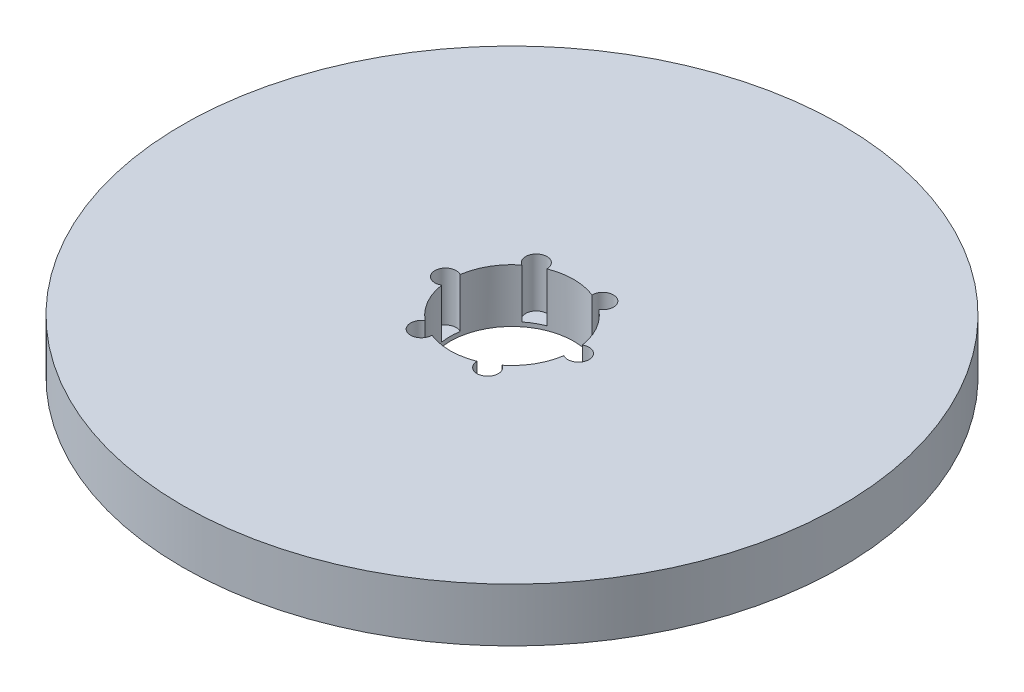
ISO-10303-21;
HEADER;
FILE_DESCRIPTION(('STEP AP214'),'2;1');
FILE_NAME('part.step','',(''),(''),'','','');
FILE_SCHEMA(('AUTOMOTIVE_DESIGN { 1 0 10303 214 1 1 1 1 }'));
ENDSEC;
DATA;
#1=APPLICATION_CONTEXT('core data for automotive mechanical design processes');
#2=APPLICATION_PROTOCOL_DEFINITION('international standard','automotive_design',2000,#1);
#3=PRODUCT_CONTEXT('',#1,'mechanical');
#4=PRODUCT('Part','Part','',(#3));
#5=PRODUCT_RELATED_PRODUCT_CATEGORY('part','',(#4));
#6=PRODUCT_DEFINITION_FORMATION('','',#4);
#7=PRODUCT_DEFINITION_CONTEXT('part definition',#1,'design');
#8=PRODUCT_DEFINITION('design','',#6,#7);
#9=PRODUCT_DEFINITION_SHAPE('','',#8);
#10=(LENGTH_UNIT() NAMED_UNIT(*) SI_UNIT(.MILLI.,.METRE.));
#11=(NAMED_UNIT(*) PLANE_ANGLE_UNIT() SI_UNIT($,.RADIAN.));
#12=(NAMED_UNIT(*) SI_UNIT($,.STERADIAN.) SOLID_ANGLE_UNIT());
#13=UNCERTAINTY_MEASURE_WITH_UNIT(LENGTH_MEASURE(1.E-05),#10,'distance_accuracy_value','');
#14=(GEOMETRIC_REPRESENTATION_CONTEXT(3) GLOBAL_UNCERTAINTY_ASSIGNED_CONTEXT((#13)) GLOBAL_UNIT_ASSIGNED_CONTEXT((#10,
#11,#12)) REPRESENTATION_CONTEXT('',''));
#15=CARTESIAN_POINT('',(0.,0.,0.));
#16=DIRECTION('',(0.,0.,1.));
#17=DIRECTION('',(1.,0.,0.));
#18=AXIS2_PLACEMENT_3D('',#15,#16,#17);
#19=CARTESIAN_POINT('',(0.,13.,0.));
#20=DIRECTION('',(0.,-1.,0.));
#21=DIRECTION('',(0.,0.,-1.));
#22=AXIS2_PLACEMENT_3D('',#19,#20,#21);
#23=CYLINDRICAL_SURFACE('',#22,80.);
#24=CARTESIAN_POINT('',(0.,13.,0.));
#25=DIRECTION('',(0.,1.,0.));
#26=DIRECTION('',(0.,0.,1.));
#27=AXIS2_PLACEMENT_3D('',#24,#25,#26);
#28=CIRCLE('',#27,80.);
#29=CARTESIAN_POINT('',(0.,13.,-80.));
#30=VERTEX_POINT('',#29);
#31=EDGE_CURVE('E171',#30,#30,#28,.T.);
#32=CARTESIAN_POINT('',(0.,0.,0.));
#33=DIRECTION('',(0.,1.,0.));
#34=DIRECTION('',(0.,0.,1.));
#35=AXIS2_PLACEMENT_3D('',#32,#33,#34);
#36=CIRCLE('',#35,80.);
#37=CARTESIAN_POINT('',(0.,0.,-80.));
#38=VERTEX_POINT('',#37);
#39=EDGE_CURVE('E157',#38,#38,#36,.T.);
#40=CARTESIAN_POINT('',(0.,13.,-80.));
#41=CARTESIAN_POINT('',(0.,12.8645833333333,-80.));
#42=CARTESIAN_POINT('',(0.,12.7291666666667,-80.));
#43=CARTESIAN_POINT('',(0.,12.4583333333333,-80.));
#44=CARTESIAN_POINT('',(0.,12.3229166666667,-80.));
#45=CARTESIAN_POINT('',(0.,12.0520833333333,-80.));
#46=CARTESIAN_POINT('',(0.,11.9166666666667,-80.));
#47=CARTESIAN_POINT('',(0.,11.6458333333333,-80.));
#48=CARTESIAN_POINT('',(0.,11.5104166666667,-80.));
#49=CARTESIAN_POINT('',(0.,11.2395833333333,-80.));
#50=CARTESIAN_POINT('',(0.,11.1041666666667,-80.));
#51=CARTESIAN_POINT('',(0.,10.8333333333333,-80.));
#52=CARTESIAN_POINT('',(0.,10.6979166666667,-80.));
#53=CARTESIAN_POINT('',(0.,10.4270833333333,-80.));
#54=CARTESIAN_POINT('',(0.,10.2916666666667,-80.));
#55=CARTESIAN_POINT('',(0.,10.0208333333333,-80.));
#56=CARTESIAN_POINT('',(0.,9.88541666666667,-80.));
#57=CARTESIAN_POINT('',(0.,9.61458333333333,-80.));
#58=CARTESIAN_POINT('',(0.,9.47916666666667,-80.));
#59=CARTESIAN_POINT('',(0.,9.20833333333333,-80.));
#60=CARTESIAN_POINT('',(0.,9.07291666666667,-80.));
#61=CARTESIAN_POINT('',(0.,8.80208333333333,-80.));
#62=CARTESIAN_POINT('',(0.,8.66666666666667,-80.));
#63=CARTESIAN_POINT('',(0.,8.39583333333333,-80.));
#64=CARTESIAN_POINT('',(0.,8.26041666666667,-80.));
#65=CARTESIAN_POINT('',(0.,7.98958333333333,-80.));
#66=CARTESIAN_POINT('',(0.,7.85416666666667,-80.));
#67=CARTESIAN_POINT('',(0.,7.58333333333333,-80.));
#68=CARTESIAN_POINT('',(0.,7.44791666666667,-80.));
#69=CARTESIAN_POINT('',(0.,7.17708333333333,-80.));
#70=CARTESIAN_POINT('',(0.,7.04166666666667,-80.));
#71=CARTESIAN_POINT('',(0.,6.77083333333333,-80.));
#72=CARTESIAN_POINT('',(0.,6.63541666666667,-80.));
#73=CARTESIAN_POINT('',(0.,6.36458333333333,-80.));
#74=CARTESIAN_POINT('',(0.,6.22916666666667,-80.));
#75=CARTESIAN_POINT('',(0.,5.95833333333333,-80.));
#76=CARTESIAN_POINT('',(0.,5.82291666666667,-80.));
#77=CARTESIAN_POINT('',(0.,5.55208333333333,-80.));
#78=CARTESIAN_POINT('',(0.,5.41666666666667,-80.));
#79=CARTESIAN_POINT('',(0.,5.14583333333333,-80.));
#80=CARTESIAN_POINT('',(0.,5.01041666666667,-80.));
#81=CARTESIAN_POINT('',(0.,4.73958333333333,-80.));
#82=CARTESIAN_POINT('',(0.,4.60416666666667,-80.));
#83=CARTESIAN_POINT('',(0.,4.33333333333333,-80.));
#84=CARTESIAN_POINT('',(0.,4.19791666666667,-80.));
#85=CARTESIAN_POINT('',(0.,3.92708333333333,-80.));
#86=CARTESIAN_POINT('',(0.,3.79166666666667,-80.));
#87=CARTESIAN_POINT('',(0.,3.52083333333333,-80.));
#88=CARTESIAN_POINT('',(0.,3.38541666666667,-80.));
#89=CARTESIAN_POINT('',(0.,3.11458333333333,-80.));
#90=CARTESIAN_POINT('',(0.,2.97916666666667,-80.));
#91=CARTESIAN_POINT('',(0.,2.70833333333333,-80.));
#92=CARTESIAN_POINT('',(0.,2.57291666666667,-80.));
#93=CARTESIAN_POINT('',(0.,2.30208333333333,-80.));
#94=CARTESIAN_POINT('',(0.,2.16666666666667,-80.));
#95=CARTESIAN_POINT('',(0.,1.89583333333333,-80.));
#96=CARTESIAN_POINT('',(0.,1.76041666666667,-80.));
#97=CARTESIAN_POINT('',(0.,1.48958333333333,-80.));
#98=CARTESIAN_POINT('',(0.,1.35416666666667,-80.));
#99=CARTESIAN_POINT('',(0.,1.08333333333333,-80.));
#100=CARTESIAN_POINT('',(0.,0.947916666666667,-80.));
#101=CARTESIAN_POINT('',(0.,0.677083333333334,-80.));
#102=CARTESIAN_POINT('',(0.,0.541666666666667,-80.));
#103=CARTESIAN_POINT('',(0.,0.270833333333334,-80.));
#104=CARTESIAN_POINT('',(0.,0.135416666666667,-80.));
#105=CARTESIAN_POINT('',(0.,0.,-80.));
#106=B_SPLINE_CURVE_WITH_KNOTS('',3,(#40,#41,#42,#43,#44,#45,#46,#47,#48,#49,#50,#51,#52,#53,
#54,#55,#56,#57,#58,#59,#60,#61,#62,#63,#64,#65,#66,#67,#68,#69,#70,#71,#72,#73,#74,#75,#76,#77,
#78,#79,#80,#81,#82,#83,#84,#85,#86,#87,#88,#89,#90,#91,#92,#93,#94,#95,#96,#97,#98,#99,#100,
#101,#102,#103,#104,#105),.UNSPECIFIED.,.F.,.F.,(4,2,2,2,2,2,2,2,2,2,2,2,2,2,2,2,2,2,2,2,2,2,2,
2,2,2,2,2,2,2,2,2,4),(0.,0.406249999999999,0.812499999999999,1.21875,1.625,2.03125,2.4375,
2.84375,3.25,3.65625,4.0625,4.46875,4.875,5.28125,5.6875,6.09375,6.5,6.90625,7.3125,7.71875,
8.125,8.53125,8.9375,9.34375,9.75,10.15625,10.5625,10.96875,11.375,11.78125,12.1875,12.59375,
13.),.UNSPECIFIED.);
#107=EDGE_CURVE('BSEAM39',#30,#38,#106,.T.);
#108=ORIENTED_EDGE('',*,*,#31,.F.);
#109=ORIENTED_EDGE('',*,*,#39,.T.);
#110=ORIENTED_EDGE('',*,*,#107,.T.);
#111=ORIENTED_EDGE('',*,*,#107,.F.);
#112=EDGE_LOOP('',(#108,#110,#109,#111));
#113=FACE_BOUND('',#112,.T.);
#114=ADVANCED_FACE('F39',(#113),#23,.T.);
#115=CARTESIAN_POINT('',(0.,13.,0.));
#116=DIRECTION('',(0.,1.,0.));
#117=DIRECTION('',(0.,0.,1.));
#118=AXIS2_PLACEMENT_3D('',#115,#116,#117);
#119=PLANE('',#118);
#120=CARTESIAN_POINT('',(-8.06547698852866,13.,-13.9698159314089));
#121=DIRECTION('',(0.,1.,0.));
#122=DIRECTION('',(-0.866025403784433,0.,0.50000000000001));
#123=AXIS2_PLACEMENT_3D('',#120,#121,#122);
#124=CIRCLE('',#123,2.58625249770629);
#125=CARTESIAN_POINT('',(-5.47923231873418,13.,-13.9634527677555));
#126=VERTEX_POINT('',#125);
#127=CARTESIAN_POINT('',(-9.35308866205358,13.,-11.726880765138));
#128=VERTEX_POINT('',#127);
#129=EDGE_CURVE('E214',#126,#128,#124,.T.);
#130=ORIENTED_EDGE('',*,*,#129,.F.);
#131=CARTESIAN_POINT('',(0.,13.,0.));
#132=DIRECTION('',(0.,1.,0.));
#133=DIRECTION('',(0.,0.,1.));
#134=AXIS2_PLACEMENT_3D('',#131,#132,#133);
#135=CIRCLE('',#134,15.);
#136=CARTESIAN_POINT('',(5.47923231873388,13.,-13.9634527677556));
#137=VERTEX_POINT('',#136);
#138=EDGE_CURVE('E272',#137,#126,#135,.T.);
#139=ORIENTED_EDGE('',*,*,#138,.F.);
#140=CARTESIAN_POINT('',(8.06547698852837,13.,-13.969815931409));
#141=DIRECTION('',(0.,1.,0.));
#142=DIRECTION('',(-0.866025403784443,0.,-0.499999999999992));
#143=AXIS2_PLACEMENT_3D('',#140,#141,#142);
#144=CIRCLE('',#143,2.58625249770629);
#145=CARTESIAN_POINT('',(9.35308866205334,13.,-11.7268807651382));
#146=VERTEX_POINT('',#145);
#147=EDGE_CURVE('E285',#146,#137,#144,.T.);
#148=ORIENTED_EDGE('',*,*,#147,.F.);
#149=CARTESIAN_POINT('',(14.8323209807875,13.,-2.23657200261741));
#150=VERTEX_POINT('',#149);
#151=EDGE_CURVE('E165',#150,#146,#135,.T.);
#152=ORIENTED_EDGE('',*,*,#151,.F.);
#153=CARTESIAN_POINT('',(16.130953977057,13.,0.));
#154=DIRECTION('',(0.,1.,0.));
#155=DIRECTION('',(0.,0.,-1.));
#156=AXIS2_PLACEMENT_3D('',#153,#154,#155);
#157=CIRCLE('',#156,2.58625249770629);
#158=CARTESIAN_POINT('',(14.8323209807875,13.,2.23657200261741));
#159=VERTEX_POINT('',#158);
#160=EDGE_CURVE('E281',#159,#150,#157,.T.);
#161=ORIENTED_EDGE('',*,*,#160,.F.);
#162=CARTESIAN_POINT('',(9.3530886620535,13.,11.7268807651381));
#163=VERTEX_POINT('',#162);
#164=EDGE_CURVE('E160',#163,#159,#135,.T.);
#165=ORIENTED_EDGE('',*,*,#164,.F.);
#166=CARTESIAN_POINT('',(8.06547698852856,13.,13.9698159314089));
#167=DIRECTION('',(0.,1.,0.));
#168=DIRECTION('',(0.866025403784436,0.,-0.500000000000004));
#169=AXIS2_PLACEMENT_3D('',#166,#167,#168);
#170=CIRCLE('',#169,2.58625249770629);
#171=CARTESIAN_POINT('',(5.47923231873408,13.,13.9634527677555));
#172=VERTEX_POINT('',#171);
#173=EDGE_CURVE('E154',#172,#163,#170,.T.);
#174=ORIENTED_EDGE('',*,*,#173,.F.);
#175=CARTESIAN_POINT('',(-5.47923231873398,13.,13.9634527677556));
#176=VERTEX_POINT('',#175);
#177=EDGE_CURVE('E150',#176,#172,#135,.T.);
#178=ORIENTED_EDGE('',*,*,#177,.F.);
#179=CARTESIAN_POINT('',(-8.06547698852846,13.,13.969815931409));
#180=DIRECTION('',(0.,1.,0.));
#181=DIRECTION('',(0.86602540378444,0.,0.499999999999998));
#182=AXIS2_PLACEMENT_3D('',#179,#180,#181);
#183=CIRCLE('',#182,2.58625249770629);
#184=CARTESIAN_POINT('',(-9.35308866205342,13.,11.7268807651382));
#185=VERTEX_POINT('',#184);
#186=EDGE_CURVE('E127',#185,#176,#183,.T.);
#187=ORIENTED_EDGE('',*,*,#186,.F.);
#188=CARTESIAN_POINT('',(-14.8323209807875,13.,2.23657200261741));
#189=VERTEX_POINT('',#188);
#190=EDGE_CURVE('E156',#189,#185,#135,.T.);
#191=ORIENTED_EDGE('',*,*,#190,.F.);
#192=CARTESIAN_POINT('',(-16.130953977057,13.,0.));
#193=DIRECTION('',(0.,1.,0.));
#194=DIRECTION('',(0.,0.,1.));
#195=AXIS2_PLACEMENT_3D('',#192,#193,#194);
#196=CIRCLE('',#195,2.58625249770629);
#197=CARTESIAN_POINT('',(-14.8323209807875,13.,-2.23657200261741));
#198=VERTEX_POINT('',#197);
#199=EDGE_CURVE('E164',#198,#189,#196,.T.);
#200=ORIENTED_EDGE('',*,*,#199,.F.);
#201=EDGE_CURVE('E159',#128,#198,#135,.T.);
#202=ORIENTED_EDGE('',*,*,#201,.F.);
#203=EDGE_LOOP('',(#130,#139,#148,#152,#161,#165,#174,#178,#187,#191,#200,#202));
#204=FACE_BOUND('',#203,.T.);
#205=ORIENTED_EDGE('',*,*,#31,.T.);
#206=EDGE_LOOP('',(#205));
#207=FACE_BOUND('',#206,.T.);
#208=ADVANCED_FACE('F155',(#204,#207),#119,.T.);
#209=CARTESIAN_POINT('',(0.,0.,0.));
#210=DIRECTION('',(0.,1.,0.));
#211=DIRECTION('',(0.,0.,1.));
#212=AXIS2_PLACEMENT_3D('',#209,#210,#211);
#213=PLANE('',#212);
#214=CARTESIAN_POINT('',(0.,0.,0.));
#215=DIRECTION('',(0.,1.,0.));
#216=DIRECTION('',(0.,0.,1.));
#217=AXIS2_PLACEMENT_3D('',#214,#215,#216);
#218=CIRCLE('',#217,15.);
#219=CARTESIAN_POINT('',(0.,0.,15.));
#220=VERTEX_POINT('',#219);
#221=EDGE_CURVE('E170',#220,#220,#218,.T.);
#222=ORIENTED_EDGE('',*,*,#221,.T.);
#223=EDGE_LOOP('',(#222));
#224=FACE_BOUND('',#223,.T.);
#225=ORIENTED_EDGE('',*,*,#39,.F.);
#226=EDGE_LOOP('',(#225));
#227=FACE_BOUND('',#226,.T.);
#228=ADVANCED_FACE('F232',(#224,#227),#213,.F.);
#229=CARTESIAN_POINT('',(0.,13.,0.));
#230=DIRECTION('',(0.,-1.,0.));
#231=DIRECTION('',(0.,0.,-1.));
#232=AXIS2_PLACEMENT_3D('',#229,#230,#231);
#233=CYLINDRICAL_SURFACE('',#232,15.);
#234=DIRECTION('',(0.,1.,0.));
#235=VECTOR('',#234,1.);
#236=CARTESIAN_POINT('',(-5.47923231873418,7.01014131296159,-13.9634527677555));
#237=LINE('',#236,#235);
#238=CARTESIAN_POINT('',(-5.47923231873418,1.02028262592318,-13.9634527677555));
#239=VERTEX_POINT('',#238);
#240=EDGE_CURVE('E11',#239,#126,#237,.T.);
#241=ORIENTED_EDGE('',*,*,#240,.F.);
#242=CARTESIAN_POINT('',(0.,1.02028262592318,0.));
#243=DIRECTION('',(0.,1.,0.));
#244=DIRECTION('',(0.,0.,1.));
#245=AXIS2_PLACEMENT_3D('',#242,#243,#244);
#246=CIRCLE('',#245,15.);
#247=CARTESIAN_POINT('',(-9.35308866205358,1.02028262592318,-11.726880765138));
#248=VERTEX_POINT('',#247);
#249=EDGE_CURVE('E209',#239,#248,#246,.T.);
#250=ORIENTED_EDGE('',*,*,#249,.T.);
#251=DIRECTION('',(0.,1.,0.));
#252=VECTOR('',#251,1.);
#253=CARTESIAN_POINT('',(-9.35308866205358,7.01014131296159,-11.726880765138));
#254=LINE('',#253,#252);
#255=EDGE_CURVE('E46',#128,#248,#254,.F.);
#256=ORIENTED_EDGE('',*,*,#255,.F.);
#257=ORIENTED_EDGE('',*,*,#201,.T.);
#258=DIRECTION('',(0.,1.,0.));
#259=VECTOR('',#258,1.);
#260=CARTESIAN_POINT('',(-14.8323209807875,7.01014131296159,-2.23657200261741));
#261=LINE('',#260,#259);
#262=CARTESIAN_POINT('',(-14.8323209807875,1.02028262592318,-2.23657200261741));
#263=VERTEX_POINT('',#262);
#264=EDGE_CURVE('E185',#263,#198,#261,.T.);
#265=ORIENTED_EDGE('',*,*,#264,.F.);
#266=CARTESIAN_POINT('',(0.,1.02028262592318,0.));
#267=DIRECTION('',(0.,1.,0.));
#268=DIRECTION('',(0.,0.,1.));
#269=AXIS2_PLACEMENT_3D('',#266,#267,#268);
#270=CIRCLE('',#269,15.);
#271=CARTESIAN_POINT('',(-14.8323209807875,1.02028262592318,2.23657200261741));
#272=VERTEX_POINT('',#271);
#273=EDGE_CURVE('E173',#263,#272,#270,.T.);
#274=ORIENTED_EDGE('',*,*,#273,.T.);
#275=DIRECTION('',(0.,1.,0.));
#276=VECTOR('',#275,1.);
#277=CARTESIAN_POINT('',(-14.8323209807875,7.01014131296159,2.23657200261741));
#278=LINE('',#277,#276);
#279=EDGE_CURVE('E178',#189,#272,#278,.F.);
#280=ORIENTED_EDGE('',*,*,#279,.F.);
#281=ORIENTED_EDGE('',*,*,#190,.T.);
#282=DIRECTION('',(0.,1.,0.));
#283=VECTOR('',#282,1.);
#284=CARTESIAN_POINT('',(-9.35308866205342,7.01014131296159,11.7268807651382));
#285=LINE('',#284,#283);
#286=CARTESIAN_POINT('',(-9.35308866205342,1.02028262592318,11.7268807651382));
#287=VERTEX_POINT('',#286);
#288=EDGE_CURVE('E132',#287,#185,#285,.T.);
#289=ORIENTED_EDGE('',*,*,#288,.F.);
#290=CARTESIAN_POINT('',(0.,1.02028262592318,0.));
#291=DIRECTION('',(0.,1.,0.));
#292=DIRECTION('',(0.,0.,1.));
#293=AXIS2_PLACEMENT_3D('',#290,#291,#292);
#294=CIRCLE('',#293,15.);
#295=CARTESIAN_POINT('',(-5.47923231873398,1.02028262592318,13.9634527677556));
#296=VERTEX_POINT('',#295);
#297=EDGE_CURVE('E146',#287,#296,#294,.T.);
#298=ORIENTED_EDGE('',*,*,#297,.T.);
#299=DIRECTION('',(0.,1.,0.));
#300=VECTOR('',#299,1.);
#301=CARTESIAN_POINT('',(-5.47923231873398,7.01014131296159,13.9634527677556));
#302=LINE('',#301,#300);
#303=EDGE_CURVE('E128',#176,#296,#302,.F.);
#304=ORIENTED_EDGE('',*,*,#303,.F.);
#305=ORIENTED_EDGE('',*,*,#177,.T.);
#306=DIRECTION('',(0.,1.,0.));
#307=VECTOR('',#306,1.);
#308=CARTESIAN_POINT('',(5.47923231873408,7.01014131296159,13.9634527677555));
#309=LINE('',#308,#307);
#310=CARTESIAN_POINT('',(5.47923231873408,1.02028262592318,13.9634527677555));
#311=VERTEX_POINT('',#310);
#312=EDGE_CURVE('E192',#311,#172,#309,.T.);
#313=ORIENTED_EDGE('',*,*,#312,.F.);
#314=CARTESIAN_POINT('',(0.,1.02028262592318,0.));
#315=DIRECTION('',(0.,1.,0.));
#316=DIRECTION('',(0.,0.,1.));
#317=AXIS2_PLACEMENT_3D('',#314,#315,#316);
#318=CIRCLE('',#317,15.);
#319=CARTESIAN_POINT('',(9.3530886620535,1.02028262592318,11.7268807651381));
#320=VERTEX_POINT('',#319);
#321=EDGE_CURVE('E190',#311,#320,#318,.T.);
#322=ORIENTED_EDGE('',*,*,#321,.T.);
#323=DIRECTION('',(0.,1.,0.));
#324=VECTOR('',#323,1.);
#325=CARTESIAN_POINT('',(9.3530886620535,7.01014131296159,11.7268807651381));
#326=LINE('',#325,#324);
#327=EDGE_CURVE('E189',#163,#320,#326,.F.);
#328=ORIENTED_EDGE('',*,*,#327,.F.);
#329=ORIENTED_EDGE('',*,*,#164,.T.);
#330=DIRECTION('',(0.,1.,0.));
#331=VECTOR('',#330,1.);
#332=CARTESIAN_POINT('',(14.8323209807875,7.01014131296159,2.23657200261741));
#333=LINE('',#332,#331);
#334=CARTESIAN_POINT('',(14.8323209807875,1.02028262592318,2.23657200261741));
#335=VERTEX_POINT('',#334);
#336=EDGE_CURVE('E203',#335,#159,#333,.T.);
#337=ORIENTED_EDGE('',*,*,#336,.F.);
#338=CARTESIAN_POINT('',(0.,1.02028262592318,0.));
#339=DIRECTION('',(0.,1.,0.));
#340=DIRECTION('',(0.,0.,1.));
#341=AXIS2_PLACEMENT_3D('',#338,#339,#340);
#342=CIRCLE('',#341,15.);
#343=CARTESIAN_POINT('',(14.8323209807875,1.02028262592318,-2.23657200261741));
#344=VERTEX_POINT('',#343);
#345=EDGE_CURVE('E194',#335,#344,#342,.T.);
#346=ORIENTED_EDGE('',*,*,#345,.T.);
#347=DIRECTION('',(0.,1.,0.));
#348=VECTOR('',#347,1.);
#349=CARTESIAN_POINT('',(14.8323209807875,7.01014131296159,-2.23657200261741));
#350=LINE('',#349,#348);
#351=EDGE_CURVE('E196',#150,#344,#350,.F.);
#352=ORIENTED_EDGE('',*,*,#351,.F.);
#353=ORIENTED_EDGE('',*,*,#151,.T.);
#354=DIRECTION('',(0.,1.,0.));
#355=VECTOR('',#354,1.);
#356=CARTESIAN_POINT('',(9.35308866205334,7.01014131296159,-11.7268807651382));
#357=LINE('',#356,#355);
#358=CARTESIAN_POINT('',(9.35308866205334,1.02028262592318,-11.7268807651382));
#359=VERTEX_POINT('',#358);
#360=EDGE_CURVE('E208',#359,#146,#357,.T.);
#361=ORIENTED_EDGE('',*,*,#360,.F.);
#362=CARTESIAN_POINT('',(0.,1.02028262592318,0.));
#363=DIRECTION('',(0.,1.,0.));
#364=DIRECTION('',(0.,0.,1.));
#365=AXIS2_PLACEMENT_3D('',#362,#363,#364);
#366=CIRCLE('',#365,15.);
#367=CARTESIAN_POINT('',(5.47923231873388,1.02028262592318,-13.9634527677556));
#368=VERTEX_POINT('',#367);
#369=EDGE_CURVE('E201',#359,#368,#366,.T.);
#370=ORIENTED_EDGE('',*,*,#369,.T.);
#371=DIRECTION('',(0.,1.,0.));
#372=VECTOR('',#371,1.);
#373=CARTESIAN_POINT('',(5.47923231873388,7.01014131296159,-13.9634527677556));
#374=LINE('',#373,#372);
#375=EDGE_CURVE('E206',#137,#368,#374,.F.);
#376=ORIENTED_EDGE('',*,*,#375,.F.);
#377=ORIENTED_EDGE('',*,*,#138,.T.);
#378=EDGE_LOOP('',(#241,#250,#256,#257,#265,#274,#280,#281,#289,#298,#304,#305,#313,#322,#328,
#329,#337,#346,#352,#353,#361,#370,#376,#377));
#379=FACE_BOUND('',#378,.T.);
#380=ORIENTED_EDGE('',*,*,#221,.F.);
#381=EDGE_LOOP('',(#380));
#382=FACE_BOUND('',#381,.T.);
#383=ADVANCED_FACE('F145',(#379,#382),#233,.F.);
#384=CARTESIAN_POINT('',(-16.130953977057,1.02028262592318,0.));
#385=DIRECTION('',(0.,1.,0.));
#386=DIRECTION('',(0.,0.,1.));
#387=AXIS2_PLACEMENT_3D('',#384,#385,#386);
#388=CYLINDRICAL_SURFACE('',#387,2.58625249770629);
#389=ORIENTED_EDGE('',*,*,#264,.T.);
#390=ORIENTED_EDGE('',*,*,#199,.T.);
#391=ORIENTED_EDGE('',*,*,#279,.T.);
#392=CARTESIAN_POINT('',(-16.130953977057,1.02028262592318,0.));
#393=DIRECTION('',(0.,1.,0.));
#394=DIRECTION('',(0.,0.,1.));
#395=AXIS2_PLACEMENT_3D('',#392,#393,#394);
#396=CIRCLE('',#395,2.58625249770629);
#397=EDGE_CURVE('E168',#263,#272,#396,.T.);
#398=ORIENTED_EDGE('',*,*,#397,.F.);
#399=EDGE_LOOP('',(#389,#390,#391,#398));
#400=FACE_BOUND('',#399,.T.);
#401=ADVANCED_FACE('F243',(#400),#388,.F.);
#402=CARTESIAN_POINT('',(-16.130953977057,1.02028262592318,0.));
#403=DIRECTION('',(0.,1.,0.));
#404=DIRECTION('',(0.,0.,1.));
#405=AXIS2_PLACEMENT_3D('',#402,#403,#404);
#406=PLANE('',#405);
#407=ORIENTED_EDGE('',*,*,#397,.T.);
#408=ORIENTED_EDGE('',*,*,#273,.F.);
#409=EDGE_LOOP('',(#407,#408));
#410=FACE_BOUND('',#409,.T.);
#411=ADVANCED_FACE('F247',(#410),#406,.T.);
#412=CARTESIAN_POINT('',(-8.06547698852846,1.02028262592318,13.969815931409));
#413=DIRECTION('',(0.,1.,0.));
#414=DIRECTION('',(0.,0.,1.));
#415=AXIS2_PLACEMENT_3D('',#412,#413,#414);
#416=CYLINDRICAL_SURFACE('',#415,2.58625249770629);
#417=ORIENTED_EDGE('',*,*,#288,.T.);
#418=ORIENTED_EDGE('',*,*,#186,.T.);
#419=ORIENTED_EDGE('',*,*,#303,.T.);
#420=CARTESIAN_POINT('',(-8.06547698852846,1.02028262592318,13.969815931409));
#421=DIRECTION('',(0.,1.,0.));
#422=DIRECTION('',(0.86602540378444,0.,0.499999999999998));
#423=AXIS2_PLACEMENT_3D('',#420,#421,#422);
#424=CIRCLE('',#423,2.58625249770629);
#425=EDGE_CURVE('E137',#287,#296,#424,.T.);
#426=ORIENTED_EDGE('',*,*,#425,.F.);
#427=EDGE_LOOP('',(#417,#418,#419,#426));
#428=FACE_BOUND('',#427,.T.);
#429=ADVANCED_FACE('F126',(#428),#416,.F.);
#430=CARTESIAN_POINT('',(-8.06547698852846,1.02028262592318,13.969815931409));
#431=DIRECTION('',(0.,1.,0.));
#432=DIRECTION('',(0.86602540378444,0.,0.499999999999998));
#433=AXIS2_PLACEMENT_3D('',#430,#431,#432);
#434=PLANE('',#433);
#435=ORIENTED_EDGE('',*,*,#425,.T.);
#436=ORIENTED_EDGE('',*,*,#297,.F.);
#437=EDGE_LOOP('',(#435,#436));
#438=FACE_BOUND('',#437,.T.);
#439=ADVANCED_FACE('F254',(#438),#434,.T.);
#440=CARTESIAN_POINT('',(8.06547698852856,1.02028262592318,13.9698159314089));
#441=DIRECTION('',(0.,1.,0.));
#442=DIRECTION('',(0.,0.,1.));
#443=AXIS2_PLACEMENT_3D('',#440,#441,#442);
#444=CYLINDRICAL_SURFACE('',#443,2.58625249770629);
#445=ORIENTED_EDGE('',*,*,#312,.T.);
#446=ORIENTED_EDGE('',*,*,#173,.T.);
#447=ORIENTED_EDGE('',*,*,#327,.T.);
#448=CARTESIAN_POINT('',(8.06547698852856,1.02028262592318,13.9698159314089));
#449=DIRECTION('',(0.,1.,0.));
#450=DIRECTION('',(0.866025403784436,0.,-0.500000000000004));
#451=AXIS2_PLACEMENT_3D('',#448,#449,#450);
#452=CIRCLE('',#451,2.58625249770629);
#453=EDGE_CURVE('E138',#311,#320,#452,.T.);
#454=ORIENTED_EDGE('',*,*,#453,.F.);
#455=EDGE_LOOP('',(#445,#446,#447,#454));
#456=FACE_BOUND('',#455,.T.);
#457=ADVANCED_FACE('F260',(#456),#444,.F.);
#458=CARTESIAN_POINT('',(8.06547698852856,1.02028262592318,13.9698159314089));
#459=DIRECTION('',(0.,1.,0.));
#460=DIRECTION('',(0.866025403784436,0.,-0.500000000000004));
#461=AXIS2_PLACEMENT_3D('',#458,#459,#460);
#462=PLANE('',#461);
#463=ORIENTED_EDGE('',*,*,#453,.T.);
#464=ORIENTED_EDGE('',*,*,#321,.F.);
#465=EDGE_LOOP('',(#463,#464));
#466=FACE_BOUND('',#465,.T.);
#467=ADVANCED_FACE('F265',(#466),#462,.T.);
#468=CARTESIAN_POINT('',(16.130953977057,1.02028262592318,0.));
#469=DIRECTION('',(0.,1.,0.));
#470=DIRECTION('',(0.,0.,1.));
#471=AXIS2_PLACEMENT_3D('',#468,#469,#470);
#472=CYLINDRICAL_SURFACE('',#471,2.58625249770629);
#473=ORIENTED_EDGE('',*,*,#336,.T.);
#474=ORIENTED_EDGE('',*,*,#160,.T.);
#475=ORIENTED_EDGE('',*,*,#351,.T.);
#476=CARTESIAN_POINT('',(16.130953977057,1.02028262592318,0.));
#477=DIRECTION('',(0.,1.,0.));
#478=DIRECTION('',(0.,0.,-1.));
#479=AXIS2_PLACEMENT_3D('',#476,#477,#478);
#480=CIRCLE('',#479,2.58625249770629);
#481=EDGE_CURVE('E287',#335,#344,#480,.T.);
#482=ORIENTED_EDGE('',*,*,#481,.F.);
#483=EDGE_LOOP('',(#473,#474,#475,#482));
#484=FACE_BOUND('',#483,.T.);
#485=ADVANCED_FACE('F300',(#484),#472,.F.);
#486=CARTESIAN_POINT('',(16.130953977057,1.02028262592318,0.));
#487=DIRECTION('',(0.,1.,0.));
#488=DIRECTION('',(0.,0.,-1.));
#489=AXIS2_PLACEMENT_3D('',#486,#487,#488);
#490=PLANE('',#489);
#491=ORIENTED_EDGE('',*,*,#481,.T.);
#492=ORIENTED_EDGE('',*,*,#345,.F.);
#493=EDGE_LOOP('',(#491,#492));
#494=FACE_BOUND('',#493,.T.);
#495=ADVANCED_FACE('F298',(#494),#490,.T.);
#496=CARTESIAN_POINT('',(8.06547698852837,1.02028262592318,-13.969815931409));
#497=DIRECTION('',(0.,1.,0.));
#498=DIRECTION('',(0.,0.,1.));
#499=AXIS2_PLACEMENT_3D('',#496,#497,#498);
#500=CYLINDRICAL_SURFACE('',#499,2.58625249770629);
#501=ORIENTED_EDGE('',*,*,#360,.T.);
#502=ORIENTED_EDGE('',*,*,#147,.T.);
#503=ORIENTED_EDGE('',*,*,#375,.T.);
#504=CARTESIAN_POINT('',(8.06547698852837,1.02028262592318,-13.969815931409));
#505=DIRECTION('',(0.,1.,0.));
#506=DIRECTION('',(-0.866025403784443,0.,-0.499999999999992));
#507=AXIS2_PLACEMENT_3D('',#504,#505,#506);
#508=CIRCLE('',#507,2.58625249770629);
#509=EDGE_CURVE('E56',#359,#368,#508,.T.);
#510=ORIENTED_EDGE('',*,*,#509,.F.);
#511=EDGE_LOOP('',(#501,#502,#503,#510));
#512=FACE_BOUND('',#511,.T.);
#513=ADVANCED_FACE('F301',(#512),#500,.F.);
#514=CARTESIAN_POINT('',(8.06547698852837,1.02028262592318,-13.969815931409));
#515=DIRECTION('',(0.,1.,0.));
#516=DIRECTION('',(-0.866025403784443,0.,-0.499999999999992));
#517=AXIS2_PLACEMENT_3D('',#514,#515,#516);
#518=PLANE('',#517);
#519=ORIENTED_EDGE('',*,*,#509,.T.);
#520=ORIENTED_EDGE('',*,*,#369,.F.);
#521=EDGE_LOOP('',(#519,#520));
#522=FACE_BOUND('',#521,.T.);
#523=ADVANCED_FACE('F221',(#522),#518,.T.);
#524=CARTESIAN_POINT('',(-8.06547698852866,1.02028262592318,-13.9698159314089));
#525=DIRECTION('',(0.,1.,0.));
#526=DIRECTION('',(0.,0.,1.));
#527=AXIS2_PLACEMENT_3D('',#524,#525,#526);
#528=CYLINDRICAL_SURFACE('',#527,2.58625249770629);
#529=ORIENTED_EDGE('',*,*,#240,.T.);
#530=ORIENTED_EDGE('',*,*,#129,.T.);
#531=ORIENTED_EDGE('',*,*,#255,.T.);
#532=CARTESIAN_POINT('',(-8.06547698852866,1.02028262592318,-13.9698159314089));
#533=DIRECTION('',(0.,1.,0.));
#534=DIRECTION('',(-0.866025403784433,0.,0.50000000000001));
#535=AXIS2_PLACEMENT_3D('',#532,#533,#534);
#536=CIRCLE('',#535,2.58625249770629);
#537=EDGE_CURVE('E55',#239,#248,#536,.T.);
#538=ORIENTED_EDGE('',*,*,#537,.F.);
#539=EDGE_LOOP('',(#529,#530,#531,#538));
#540=FACE_BOUND('',#539,.T.);
#541=ADVANCED_FACE('F212',(#540),#528,.F.);
#542=CARTESIAN_POINT('',(-8.06547698852866,1.02028262592318,-13.9698159314089));
#543=DIRECTION('',(0.,1.,0.));
#544=DIRECTION('',(-0.866025403784433,0.,0.50000000000001));
#545=AXIS2_PLACEMENT_3D('',#542,#543,#544);
#546=PLANE('',#545);
#547=ORIENTED_EDGE('',*,*,#537,.T.);
#548=ORIENTED_EDGE('',*,*,#249,.F.);
#549=EDGE_LOOP('',(#547,#548));
#550=FACE_BOUND('',#549,.T.);
#551=ADVANCED_FACE('F217',(#550),#546,.T.);
#552=CLOSED_SHELL('',(#114,#208,#228,#383,#401,#411,#429,#439,#457,#467,#485,#495,#513,#523,
#541,#551));
#553=MANIFOLD_SOLID_BREP('B2',#552);
#554=ADVANCED_BREP_SHAPE_REPRESENTATION('',(#18,#553),#14);
#555=SHAPE_DEFINITION_REPRESENTATION(#9,#554);
ENDSEC;
END-ISO-10303-21;
